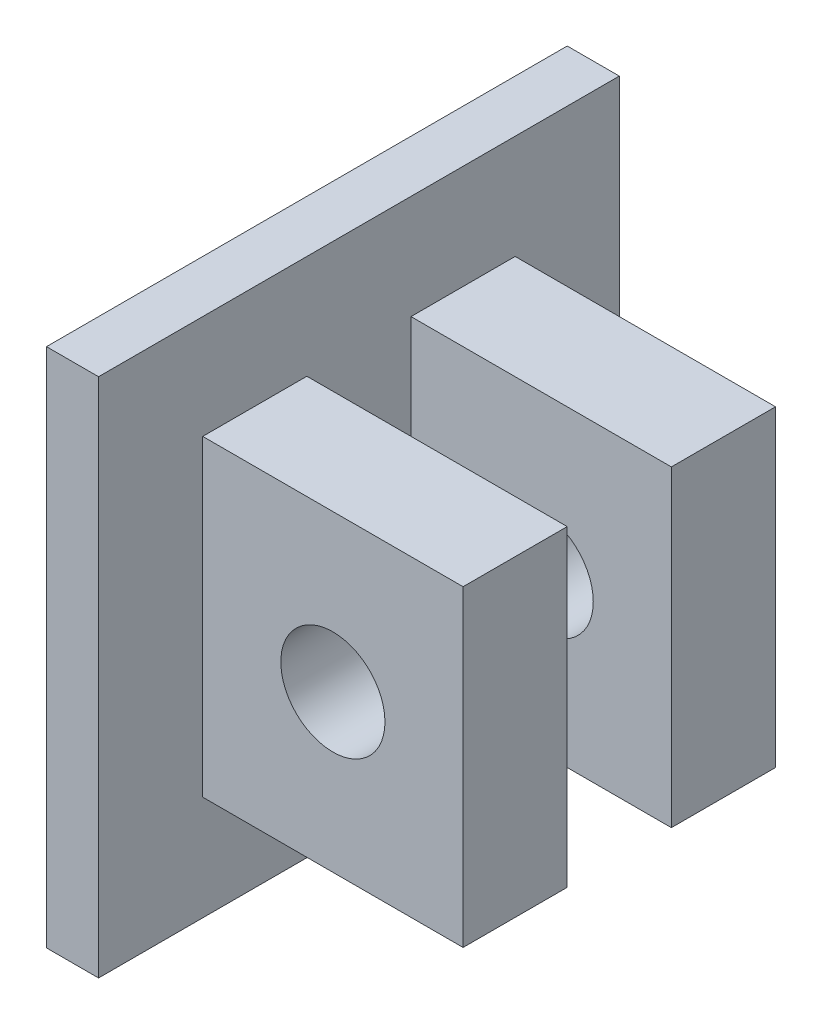
ISO-10303-21;
HEADER;
FILE_DESCRIPTION(('STEP AP214'),'2;1');
FILE_NAME('part.step','',(''),(''),'','','');
FILE_SCHEMA(('AUTOMOTIVE_DESIGN { 1 0 10303 214 1 1 1 1 }'));
ENDSEC;
DATA;
#1=APPLICATION_CONTEXT('core data for automotive mechanical design processes');
#2=APPLICATION_PROTOCOL_DEFINITION('international standard','automotive_design',2000,#1);
#3=PRODUCT_CONTEXT('',#1,'mechanical');
#4=PRODUCT('Part','Part','',(#3));
#5=PRODUCT_RELATED_PRODUCT_CATEGORY('part','',(#4));
#6=PRODUCT_DEFINITION_FORMATION('','',#4);
#7=PRODUCT_DEFINITION_CONTEXT('part definition',#1,'design');
#8=PRODUCT_DEFINITION('design','',#6,#7);
#9=PRODUCT_DEFINITION_SHAPE('','',#8);
#10=(LENGTH_UNIT() NAMED_UNIT(*) SI_UNIT(.MILLI.,.METRE.));
#11=(NAMED_UNIT(*) PLANE_ANGLE_UNIT() SI_UNIT($,.RADIAN.));
#12=(NAMED_UNIT(*) SI_UNIT($,.STERADIAN.) SOLID_ANGLE_UNIT());
#13=UNCERTAINTY_MEASURE_WITH_UNIT(LENGTH_MEASURE(1.E-05),#10,'distance_accuracy_value','');
#14=(GEOMETRIC_REPRESENTATION_CONTEXT(3) GLOBAL_UNCERTAINTY_ASSIGNED_CONTEXT((#13)) GLOBAL_UNIT_ASSIGNED_CONTEXT((#10,
#11,#12)) REPRESENTATION_CONTEXT('',''));
#15=CARTESIAN_POINT('',(0.,0.,0.));
#16=DIRECTION('',(0.,0.,1.));
#17=DIRECTION('',(1.,0.,0.));
#18=AXIS2_PLACEMENT_3D('',#15,#16,#17);
#19=CARTESIAN_POINT('',(10.,0.,0.));
#20=DIRECTION('',(-1.,0.,0.));
#21=DIRECTION('',(0.,0.,1.));
#22=AXIS2_PLACEMENT_3D('',#19,#20,#21);
#23=PLANE('',#22);
#24=DIRECTION('',(0.,1.,0.));
#25=VECTOR('',#24,1.);
#26=CARTESIAN_POINT('',(10.,-29.9239199967732,10.));
#27=LINE('',#26,#25);
#28=CARTESIAN_POINT('',(10.,-29.9239199967732,10.));
#29=VERTEX_POINT('',#28);
#30=CARTESIAN_POINT('',(10.,30.0760800032268,10.));
#31=VERTEX_POINT('',#30);
#32=EDGE_CURVE('E139',#29,#31,#27,.T.);
#33=ORIENTED_EDGE('',*,*,#32,.F.);
#34=DIRECTION('',(0.,0.,-1.));
#35=VECTOR('',#34,1.);
#36=CARTESIAN_POINT('',(10.,-29.9239199967732,10.));
#37=LINE('',#36,#35);
#38=CARTESIAN_POINT('',(10.,-29.9239199967732,30.));
#39=VERTEX_POINT('',#38);
#40=EDGE_CURVE('E182',#39,#29,#37,.T.);
#41=ORIENTED_EDGE('',*,*,#40,.F.);
#42=DIRECTION('',(0.,-1.,0.));
#43=VECTOR('',#42,1.);
#44=CARTESIAN_POINT('',(10.,-29.9239199967732,30.));
#45=LINE('',#44,#43);
#46=CARTESIAN_POINT('',(10.,30.0760800032268,30.));
#47=VERTEX_POINT('',#46);
#48=EDGE_CURVE('E199',#47,#39,#45,.T.);
#49=ORIENTED_EDGE('',*,*,#48,.F.);
#50=DIRECTION('',(0.,0.,1.));
#51=VECTOR('',#50,1.);
#52=CARTESIAN_POINT('',(10.,30.0760800032268,10.));
#53=LINE('',#52,#51);
#54=EDGE_CURVE('E195',#31,#47,#53,.T.);
#55=ORIENTED_EDGE('',*,*,#54,.F.);
#56=EDGE_LOOP('',(#33,#41,#49,#55));
#57=FACE_BOUND('',#56,.T.);
#58=DIRECTION('',(0.,1.,0.));
#59=VECTOR('',#58,1.);
#60=CARTESIAN_POINT('',(10.,-50.,-50.));
#61=LINE('',#60,#59);
#62=CARTESIAN_POINT('',(10.,-50.,-50.));
#63=VERTEX_POINT('',#62);
#64=CARTESIAN_POINT('',(10.,50.,-50.));
#65=VERTEX_POINT('',#64);
#66=EDGE_CURVE('E222',#63,#65,#61,.T.);
#67=ORIENTED_EDGE('',*,*,#66,.T.);
#68=DIRECTION('',(0.,0.,1.));
#69=VECTOR('',#68,1.);
#70=CARTESIAN_POINT('',(10.,50.,50.));
#71=LINE('',#70,#69);
#72=CARTESIAN_POINT('',(10.,50.,50.));
#73=VERTEX_POINT('',#72);
#74=EDGE_CURVE('E226',#65,#73,#71,.T.);
#75=ORIENTED_EDGE('',*,*,#74,.T.);
#76=DIRECTION('',(0.,-1.,0.));
#77=VECTOR('',#76,1.);
#78=CARTESIAN_POINT('',(10.,-50.,50.));
#79=LINE('',#78,#77);
#80=CARTESIAN_POINT('',(10.,-50.,50.));
#81=VERTEX_POINT('',#80);
#82=EDGE_CURVE('E230',#73,#81,#79,.T.);
#83=ORIENTED_EDGE('',*,*,#82,.T.);
#84=DIRECTION('',(0.,0.,-1.));
#85=VECTOR('',#84,1.);
#86=CARTESIAN_POINT('',(10.,-50.,50.));
#87=LINE('',#86,#85);
#88=EDGE_CURVE('E233',#81,#63,#87,.T.);
#89=ORIENTED_EDGE('',*,*,#88,.T.);
#90=EDGE_LOOP('',(#67,#75,#83,#89));
#91=FACE_BOUND('',#90,.T.);
#92=DIRECTION('',(0.,1.,0.));
#93=VECTOR('',#92,1.);
#94=CARTESIAN_POINT('',(10.,-30.,-30.));
#95=LINE('',#94,#93);
#96=CARTESIAN_POINT('',(10.,-30.,-30.));
#97=VERTEX_POINT('',#96);
#98=CARTESIAN_POINT('',(10.,30.,-30.));
#99=VERTEX_POINT('',#98);
#100=EDGE_CURVE('E132',#97,#99,#95,.T.);
#101=ORIENTED_EDGE('',*,*,#100,.F.);
#102=DIRECTION('',(0.,0.,-1.));
#103=VECTOR('',#102,1.);
#104=CARTESIAN_POINT('',(10.,-30.,-30.));
#105=LINE('',#104,#103);
#106=CARTESIAN_POINT('',(10.,-30.,-10.));
#107=VERTEX_POINT('',#106);
#108=EDGE_CURVE('E134',#107,#97,#105,.T.);
#109=ORIENTED_EDGE('',*,*,#108,.F.);
#110=DIRECTION('',(0.,-1.,0.));
#111=VECTOR('',#110,1.);
#112=CARTESIAN_POINT('',(10.,-30.,-10.));
#113=LINE('',#112,#111);
#114=CARTESIAN_POINT('',(10.,30.,-10.));
#115=VERTEX_POINT('',#114);
#116=EDGE_CURVE('E67',#115,#107,#113,.T.);
#117=ORIENTED_EDGE('',*,*,#116,.F.);
#118=DIRECTION('',(0.,0.,1.));
#119=VECTOR('',#118,1.);
#120=CARTESIAN_POINT('',(10.,30.,-30.));
#121=LINE('',#120,#119);
#122=EDGE_CURVE('E62',#99,#115,#121,.T.);
#123=ORIENTED_EDGE('',*,*,#122,.F.);
#124=EDGE_LOOP('',(#101,#109,#117,#123));
#125=FACE_BOUND('',#124,.T.);
#126=ADVANCED_FACE('F45',(#57,#91,#125),#23,.F.);
#127=CARTESIAN_POINT('',(10.,-50.,-50.));
#128=DIRECTION('',(0.,0.,1.));
#129=DIRECTION('',(1.,0.,0.));
#130=AXIS2_PLACEMENT_3D('',#127,#128,#129);
#131=PLANE('',#130);
#132=DIRECTION('',(0.,1.,0.));
#133=VECTOR('',#132,1.);
#134=CARTESIAN_POINT('',(0.,-50.,-50.));
#135=LINE('',#134,#133);
#136=CARTESIAN_POINT('',(0.,-50.,-50.));
#137=VERTEX_POINT('',#136);
#138=CARTESIAN_POINT('',(0.,50.,-50.));
#139=VERTEX_POINT('',#138);
#140=EDGE_CURVE('E221',#137,#139,#135,.T.);
#141=ORIENTED_EDGE('',*,*,#140,.T.);
#142=DIRECTION('',(-1.,0.,0.));
#143=VECTOR('',#142,1.);
#144=CARTESIAN_POINT('',(10.,50.,-50.));
#145=LINE('',#144,#143);
#146=EDGE_CURVE('E11',#65,#139,#145,.T.);
#147=ORIENTED_EDGE('',*,*,#146,.F.);
#148=ORIENTED_EDGE('',*,*,#66,.F.);
#149=DIRECTION('',(-1.,0.,0.));
#150=VECTOR('',#149,1.);
#151=CARTESIAN_POINT('',(10.,-50.,-50.));
#152=LINE('',#151,#150);
#153=EDGE_CURVE('E236',#63,#137,#152,.T.);
#154=ORIENTED_EDGE('',*,*,#153,.T.);
#155=EDGE_LOOP('',(#141,#147,#148,#154));
#156=FACE_BOUND('',#155,.T.);
#157=ADVANCED_FACE('F47',(#156),#131,.F.);
#158=CARTESIAN_POINT('',(10.,50.,50.));
#159=DIRECTION('',(0.,-1.,0.));
#160=DIRECTION('',(0.,0.,-1.));
#161=AXIS2_PLACEMENT_3D('',#158,#159,#160);
#162=PLANE('',#161);
#163=DIRECTION('',(0.,0.,1.));
#164=VECTOR('',#163,1.);
#165=CARTESIAN_POINT('',(0.,50.,50.));
#166=LINE('',#165,#164);
#167=CARTESIAN_POINT('',(0.,50.,50.));
#168=VERTEX_POINT('',#167);
#169=EDGE_CURVE('E240',#139,#168,#166,.T.);
#170=ORIENTED_EDGE('',*,*,#169,.T.);
#171=DIRECTION('',(-1.,0.,0.));
#172=VECTOR('',#171,1.);
#173=CARTESIAN_POINT('',(10.,50.,50.));
#174=LINE('',#173,#172);
#175=EDGE_CURVE('E55',#73,#168,#174,.T.);
#176=ORIENTED_EDGE('',*,*,#175,.F.);
#177=ORIENTED_EDGE('',*,*,#74,.F.);
#178=ORIENTED_EDGE('',*,*,#146,.T.);
#179=EDGE_LOOP('',(#170,#176,#177,#178));
#180=FACE_BOUND('',#179,.T.);
#181=ADVANCED_FACE('F276',(#180),#162,.F.);
#182=CARTESIAN_POINT('',(10.,-50.,50.));
#183=DIRECTION('',(0.,0.,-1.));
#184=DIRECTION('',(-1.,0.,0.));
#185=AXIS2_PLACEMENT_3D('',#182,#183,#184);
#186=PLANE('',#185);
#187=DIRECTION('',(0.,-1.,0.));
#188=VECTOR('',#187,1.);
#189=CARTESIAN_POINT('',(0.,-50.,50.));
#190=LINE('',#189,#188);
#191=CARTESIAN_POINT('',(0.,-50.,50.));
#192=VERTEX_POINT('',#191);
#193=EDGE_CURVE('E243',#168,#192,#190,.T.);
#194=ORIENTED_EDGE('',*,*,#193,.T.);
#195=DIRECTION('',(-1.,0.,0.));
#196=VECTOR('',#195,1.);
#197=CARTESIAN_POINT('',(10.,-50.,50.));
#198=LINE('',#197,#196);
#199=EDGE_CURVE('E251',#81,#192,#198,.T.);
#200=ORIENTED_EDGE('',*,*,#199,.F.);
#201=ORIENTED_EDGE('',*,*,#82,.F.);
#202=ORIENTED_EDGE('',*,*,#175,.T.);
#203=EDGE_LOOP('',(#194,#200,#201,#202));
#204=FACE_BOUND('',#203,.T.);
#205=ADVANCED_FACE('F261',(#204),#186,.F.);
#206=CARTESIAN_POINT('',(10.,-50.,50.));
#207=DIRECTION('',(0.,1.,0.));
#208=DIRECTION('',(0.,0.,1.));
#209=AXIS2_PLACEMENT_3D('',#206,#207,#208);
#210=PLANE('',#209);
#211=DIRECTION('',(0.,0.,-1.));
#212=VECTOR('',#211,1.);
#213=CARTESIAN_POINT('',(0.,-50.,50.));
#214=LINE('',#213,#212);
#215=EDGE_CURVE('E227',#192,#137,#214,.T.);
#216=ORIENTED_EDGE('',*,*,#215,.T.);
#217=ORIENTED_EDGE('',*,*,#153,.F.);
#218=ORIENTED_EDGE('',*,*,#88,.F.);
#219=ORIENTED_EDGE('',*,*,#199,.T.);
#220=EDGE_LOOP('',(#216,#217,#218,#219));
#221=FACE_BOUND('',#220,.T.);
#222=ADVANCED_FACE('F270',(#221),#210,.F.);
#223=CARTESIAN_POINT('',(0.,0.,0.));
#224=DIRECTION('',(-1.,0.,0.));
#225=DIRECTION('',(0.,0.,1.));
#226=AXIS2_PLACEMENT_3D('',#223,#224,#225);
#227=PLANE('',#226);
#228=ORIENTED_EDGE('',*,*,#140,.F.);
#229=ORIENTED_EDGE('',*,*,#215,.F.);
#230=ORIENTED_EDGE('',*,*,#193,.F.);
#231=ORIENTED_EDGE('',*,*,#169,.F.);
#232=EDGE_LOOP('',(#228,#229,#230,#231));
#233=FACE_BOUND('',#232,.T.);
#234=ADVANCED_FACE('F267',(#233),#227,.T.);
#235=CARTESIAN_POINT('',(60.,-29.9239199967732,10.));
#236=DIRECTION('',(0.,0.,1.));
#237=DIRECTION('',(1.,0.,0.));
#238=AXIS2_PLACEMENT_3D('',#235,#236,#237);
#239=PLANE('',#238);
#240=CARTESIAN_POINT('',(35.,0.0760800032267601,10.));
#241=DIRECTION('',(0.,0.,1.));
#242=DIRECTION('',(1.,0.,0.));
#243=AXIS2_PLACEMENT_3D('',#240,#241,#242);
#244=CIRCLE('',#243,10.);
#245=CARTESIAN_POINT('',(45.,0.0760800032267601,10.));
#246=VERTEX_POINT('',#245);
#247=EDGE_CURVE('E431',#246,#246,#244,.T.);
#248=ORIENTED_EDGE('',*,*,#247,.T.);
#249=EDGE_LOOP('',(#248));
#250=FACE_BOUND('',#249,.T.);
#251=ORIENTED_EDGE('',*,*,#32,.T.);
#252=DIRECTION('',(-1.,0.,0.));
#253=VECTOR('',#252,1.);
#254=CARTESIAN_POINT('',(60.,30.0760800032268,10.));
#255=LINE('',#254,#253);
#256=CARTESIAN_POINT('',(60.,30.0760800032268,10.));
#257=VERTEX_POINT('',#256);
#258=EDGE_CURVE('E217',#257,#31,#255,.T.);
#259=ORIENTED_EDGE('',*,*,#258,.F.);
#260=DIRECTION('',(0.,1.,0.));
#261=VECTOR('',#260,1.);
#262=CARTESIAN_POINT('',(60.,-29.9239199967732,10.));
#263=LINE('',#262,#261);
#264=CARTESIAN_POINT('',(60.,-29.9239199967732,10.));
#265=VERTEX_POINT('',#264);
#266=EDGE_CURVE('E177',#265,#257,#263,.T.);
#267=ORIENTED_EDGE('',*,*,#266,.F.);
#268=DIRECTION('',(-1.,0.,0.));
#269=VECTOR('',#268,1.);
#270=CARTESIAN_POINT('',(60.,-29.9239199967732,10.));
#271=LINE('',#270,#269);
#272=EDGE_CURVE('E191',#265,#29,#271,.T.);
#273=ORIENTED_EDGE('',*,*,#272,.T.);
#274=EDGE_LOOP('',(#251,#259,#267,#273));
#275=FACE_BOUND('',#274,.T.);
#276=ADVANCED_FACE('F292',(#250,#275),#239,.F.);
#277=CARTESIAN_POINT('',(60.,30.0760800032268,10.));
#278=DIRECTION('',(0.,-1.,0.));
#279=DIRECTION('',(0.,0.,-1.));
#280=AXIS2_PLACEMENT_3D('',#277,#278,#279);
#281=PLANE('',#280);
#282=ORIENTED_EDGE('',*,*,#54,.T.);
#283=DIRECTION('',(-1.,0.,0.));
#284=VECTOR('',#283,1.);
#285=CARTESIAN_POINT('',(60.,30.0760800032268,30.));
#286=LINE('',#285,#284);
#287=CARTESIAN_POINT('',(60.,30.0760800032268,30.));
#288=VERTEX_POINT('',#287);
#289=EDGE_CURVE('E213',#288,#47,#286,.T.);
#290=ORIENTED_EDGE('',*,*,#289,.F.);
#291=DIRECTION('',(0.,0.,1.));
#292=VECTOR('',#291,1.);
#293=CARTESIAN_POINT('',(60.,30.0760800032268,10.));
#294=LINE('',#293,#292);
#295=EDGE_CURVE('E181',#257,#288,#294,.T.);
#296=ORIENTED_EDGE('',*,*,#295,.F.);
#297=ORIENTED_EDGE('',*,*,#258,.T.);
#298=EDGE_LOOP('',(#282,#290,#296,#297));
#299=FACE_BOUND('',#298,.T.);
#300=ADVANCED_FACE('F319',(#299),#281,.F.);
#301=CARTESIAN_POINT('',(60.,-29.9239199967732,30.));
#302=DIRECTION('',(0.,0.,-1.));
#303=DIRECTION('',(0.,1.,0.));
#304=AXIS2_PLACEMENT_3D('',#301,#302,#303);
#305=PLANE('',#304);
#306=CARTESIAN_POINT('',(35.,0.0760800032267601,30.));
#307=DIRECTION('',(0.,0.,1.));
#308=DIRECTION('',(1.,0.,0.));
#309=AXIS2_PLACEMENT_3D('',#306,#307,#308);
#310=CIRCLE('',#309,10.);
#311=CARTESIAN_POINT('',(45.,0.0760800032267601,30.));
#312=VERTEX_POINT('',#311);
#313=EDGE_CURVE('E428',#312,#312,#310,.T.);
#314=ORIENTED_EDGE('',*,*,#313,.F.);
#315=EDGE_LOOP('',(#314));
#316=FACE_BOUND('',#315,.T.);
#317=ORIENTED_EDGE('',*,*,#48,.T.);
#318=DIRECTION('',(-1.,0.,0.));
#319=VECTOR('',#318,1.);
#320=CARTESIAN_POINT('',(60.,-29.9239199967732,30.));
#321=LINE('',#320,#319);
#322=CARTESIAN_POINT('',(60.,-29.9239199967732,30.));
#323=VERTEX_POINT('',#322);
#324=EDGE_CURVE('E209',#323,#39,#321,.T.);
#325=ORIENTED_EDGE('',*,*,#324,.F.);
#326=DIRECTION('',(0.,-1.,0.));
#327=VECTOR('',#326,1.);
#328=CARTESIAN_POINT('',(60.,-29.9239199967732,30.));
#329=LINE('',#328,#327);
#330=EDGE_CURVE('E185',#288,#323,#329,.T.);
#331=ORIENTED_EDGE('',*,*,#330,.F.);
#332=ORIENTED_EDGE('',*,*,#289,.T.);
#333=EDGE_LOOP('',(#317,#325,#331,#332));
#334=FACE_BOUND('',#333,.T.);
#335=ADVANCED_FACE('F329',(#316,#334),#305,.F.);
#336=CARTESIAN_POINT('',(60.,-29.9239199967732,10.));
#337=DIRECTION('',(0.,1.,0.));
#338=DIRECTION('',(0.,0.,1.));
#339=AXIS2_PLACEMENT_3D('',#336,#337,#338);
#340=PLANE('',#339);
#341=ORIENTED_EDGE('',*,*,#40,.T.);
#342=ORIENTED_EDGE('',*,*,#272,.F.);
#343=DIRECTION('',(0.,0.,-1.));
#344=VECTOR('',#343,1.);
#345=CARTESIAN_POINT('',(60.,-29.9239199967732,10.));
#346=LINE('',#345,#344);
#347=EDGE_CURVE('E188',#323,#265,#346,.T.);
#348=ORIENTED_EDGE('',*,*,#347,.F.);
#349=ORIENTED_EDGE('',*,*,#324,.T.);
#350=EDGE_LOOP('',(#341,#342,#348,#349));
#351=FACE_BOUND('',#350,.T.);
#352=ADVANCED_FACE('F338',(#351),#340,.F.);
#353=CARTESIAN_POINT('',(60.,0.,0.));
#354=DIRECTION('',(1.,0.,0.));
#355=DIRECTION('',(0.,0.,-1.));
#356=AXIS2_PLACEMENT_3D('',#353,#354,#355);
#357=PLANE('',#356);
#358=ORIENTED_EDGE('',*,*,#266,.T.);
#359=ORIENTED_EDGE('',*,*,#295,.T.);
#360=ORIENTED_EDGE('',*,*,#330,.T.);
#361=ORIENTED_EDGE('',*,*,#347,.T.);
#362=EDGE_LOOP('',(#358,#359,#360,#361));
#363=FACE_BOUND('',#362,.T.);
#364=ADVANCED_FACE('F348',(#363),#357,.T.);
#365=CARTESIAN_POINT('',(60.,-30.,-30.));
#366=DIRECTION('',(0.,0.,1.));
#367=DIRECTION('',(0.,-1.,0.));
#368=AXIS2_PLACEMENT_3D('',#365,#366,#367);
#369=PLANE('',#368);
#370=CARTESIAN_POINT('',(35.,0.0760800032267601,-30.));
#371=DIRECTION('',(0.,0.,1.));
#372=DIRECTION('',(1.,0.,0.));
#373=AXIS2_PLACEMENT_3D('',#370,#371,#372);
#374=CIRCLE('',#373,10.);
#375=CARTESIAN_POINT('',(45.,0.0760800032267601,-30.));
#376=VERTEX_POINT('',#375);
#377=EDGE_CURVE('E439',#376,#376,#374,.T.);
#378=ORIENTED_EDGE('',*,*,#377,.T.);
#379=EDGE_LOOP('',(#378));
#380=FACE_BOUND('',#379,.T.);
#381=ORIENTED_EDGE('',*,*,#100,.T.);
#382=DIRECTION('',(-1.,0.,0.));
#383=VECTOR('',#382,1.);
#384=CARTESIAN_POINT('',(60.,30.,-30.));
#385=LINE('',#384,#383);
#386=CARTESIAN_POINT('',(60.,30.,-30.));
#387=VERTEX_POINT('',#386);
#388=EDGE_CURVE('E433',#387,#99,#385,.T.);
#389=ORIENTED_EDGE('',*,*,#388,.F.);
#390=DIRECTION('',(0.,1.,0.));
#391=VECTOR('',#390,1.);
#392=CARTESIAN_POINT('',(60.,-30.,-30.));
#393=LINE('',#392,#391);
#394=CARTESIAN_POINT('',(60.,-30.,-30.));
#395=VERTEX_POINT('',#394);
#396=EDGE_CURVE('E151',#395,#387,#393,.T.);
#397=ORIENTED_EDGE('',*,*,#396,.F.);
#398=DIRECTION('',(-1.,0.,0.));
#399=VECTOR('',#398,1.);
#400=CARTESIAN_POINT('',(60.,-30.,-30.));
#401=LINE('',#400,#399);
#402=EDGE_CURVE('E146',#395,#97,#401,.T.);
#403=ORIENTED_EDGE('',*,*,#402,.T.);
#404=EDGE_LOOP('',(#381,#389,#397,#403));
#405=FACE_BOUND('',#404,.T.);
#406=ADVANCED_FACE('F153',(#380,#405),#369,.F.);
#407=CARTESIAN_POINT('',(60.,30.,-30.));
#408=DIRECTION('',(0.,-1.,0.));
#409=DIRECTION('',(0.,0.,-1.));
#410=AXIS2_PLACEMENT_3D('',#407,#408,#409);
#411=PLANE('',#410);
#412=ORIENTED_EDGE('',*,*,#122,.T.);
#413=DIRECTION('',(-1.,0.,0.));
#414=VECTOR('',#413,1.);
#415=CARTESIAN_POINT('',(60.,30.,-10.));
#416=LINE('',#415,#414);
#417=CARTESIAN_POINT('',(60.,30.,-10.));
#418=VERTEX_POINT('',#417);
#419=EDGE_CURVE('E162',#418,#115,#416,.T.);
#420=ORIENTED_EDGE('',*,*,#419,.F.);
#421=DIRECTION('',(0.,0.,1.));
#422=VECTOR('',#421,1.);
#423=CARTESIAN_POINT('',(60.,30.,-30.));
#424=LINE('',#423,#422);
#425=EDGE_CURVE('E172',#387,#418,#424,.T.);
#426=ORIENTED_EDGE('',*,*,#425,.F.);
#427=ORIENTED_EDGE('',*,*,#388,.T.);
#428=EDGE_LOOP('',(#412,#420,#426,#427));
#429=FACE_BOUND('',#428,.T.);
#430=ADVANCED_FACE('F367',(#429),#411,.F.);
#431=CARTESIAN_POINT('',(60.,-30.,-10.));
#432=DIRECTION('',(0.,0.,-1.));
#433=DIRECTION('',(-1.,0.,0.));
#434=AXIS2_PLACEMENT_3D('',#431,#432,#433);
#435=PLANE('',#434);
#436=CARTESIAN_POINT('',(35.,0.0760800032267601,-10.));
#437=DIRECTION('',(0.,0.,-1.));
#438=DIRECTION('',(-1.,0.,0.));
#439=AXIS2_PLACEMENT_3D('',#436,#437,#438);
#440=CIRCLE('',#439,10.);
#441=CARTESIAN_POINT('',(25.,0.0760800032267601,-10.));
#442=VERTEX_POINT('',#441);
#443=EDGE_CURVE('E49',#442,#442,#440,.T.);
#444=ORIENTED_EDGE('',*,*,#443,.T.);
#445=EDGE_LOOP('',(#444));
#446=FACE_BOUND('',#445,.T.);
#447=ORIENTED_EDGE('',*,*,#116,.T.);
#448=DIRECTION('',(-1.,0.,0.));
#449=VECTOR('',#448,1.);
#450=CARTESIAN_POINT('',(60.,-30.,-10.));
#451=LINE('',#450,#449);
#452=CARTESIAN_POINT('',(60.,-30.,-10.));
#453=VERTEX_POINT('',#452);
#454=EDGE_CURVE('E149',#453,#107,#451,.T.);
#455=ORIENTED_EDGE('',*,*,#454,.F.);
#456=DIRECTION('',(0.,-1.,0.));
#457=VECTOR('',#456,1.);
#458=CARTESIAN_POINT('',(60.,-30.,-10.));
#459=LINE('',#458,#457);
#460=EDGE_CURVE('E160',#418,#453,#459,.T.);
#461=ORIENTED_EDGE('',*,*,#460,.F.);
#462=ORIENTED_EDGE('',*,*,#419,.T.);
#463=EDGE_LOOP('',(#447,#455,#461,#462));
#464=FACE_BOUND('',#463,.T.);
#465=ADVANCED_FACE('F377',(#446,#464),#435,.F.);
#466=CARTESIAN_POINT('',(60.,-30.,-30.));
#467=DIRECTION('',(0.,1.,0.));
#468=DIRECTION('',(0.,0.,1.));
#469=AXIS2_PLACEMENT_3D('',#466,#467,#468);
#470=PLANE('',#469);
#471=ORIENTED_EDGE('',*,*,#108,.T.);
#472=ORIENTED_EDGE('',*,*,#402,.F.);
#473=DIRECTION('',(0.,0.,-1.));
#474=VECTOR('',#473,1.);
#475=CARTESIAN_POINT('',(60.,-30.,-30.));
#476=LINE('',#475,#474);
#477=EDGE_CURVE('E156',#453,#395,#476,.T.);
#478=ORIENTED_EDGE('',*,*,#477,.F.);
#479=ORIENTED_EDGE('',*,*,#454,.T.);
#480=EDGE_LOOP('',(#471,#472,#478,#479));
#481=FACE_BOUND('',#480,.T.);
#482=ADVANCED_FACE('F144',(#481),#470,.F.);
#483=CARTESIAN_POINT('',(60.,0.,0.));
#484=DIRECTION('',(1.,0.,0.));
#485=DIRECTION('',(0.,0.,-1.));
#486=AXIS2_PLACEMENT_3D('',#483,#484,#485);
#487=PLANE('',#486);
#488=ORIENTED_EDGE('',*,*,#396,.T.);
#489=ORIENTED_EDGE('',*,*,#425,.T.);
#490=ORIENTED_EDGE('',*,*,#460,.T.);
#491=ORIENTED_EDGE('',*,*,#477,.T.);
#492=EDGE_LOOP('',(#488,#489,#490,#491));
#493=FACE_BOUND('',#492,.T.);
#494=ADVANCED_FACE('F396',(#493),#487,.T.);
#495=CARTESIAN_POINT('',(35.,0.0760800032267601,-30.));
#496=DIRECTION('',(0.,0.,1.));
#497=DIRECTION('',(1.,0.,0.));
#498=AXIS2_PLACEMENT_3D('',#495,#496,#497);
#499=CYLINDRICAL_SURFACE('',#498,10.);
#500=ORIENTED_EDGE('',*,*,#377,.F.);
#501=EDGE_LOOP('',(#500));
#502=FACE_BOUND('',#501,.T.);
#503=ORIENTED_EDGE('',*,*,#443,.F.);
#504=EDGE_LOOP('',(#503));
#505=FACE_BOUND('',#504,.T.);
#506=ADVANCED_FACE('F404',(#502,#505),#499,.F.);
#507=ORIENTED_EDGE('',*,*,#313,.T.);
#508=EDGE_LOOP('',(#507));
#509=FACE_BOUND('',#508,.T.);
#510=ORIENTED_EDGE('',*,*,#247,.F.);
#511=EDGE_LOOP('',(#510));
#512=FACE_BOUND('',#511,.T.);
#513=ADVANCED_FACE('F413',(#509,#512),#499,.F.);
#514=CLOSED_SHELL('',(#126,#157,#181,#205,#222,#234,#276,#300,#335,#352,#364,#406,#430,#465,
#482,#494,#506,#513));
#515=MANIFOLD_SOLID_BREP('B2',#514);
#516=ADVANCED_BREP_SHAPE_REPRESENTATION('',(#18,#515),#14);
#517=SHAPE_DEFINITION_REPRESENTATION(#9,#516);
ENDSEC;
END-ISO-10303-21;
